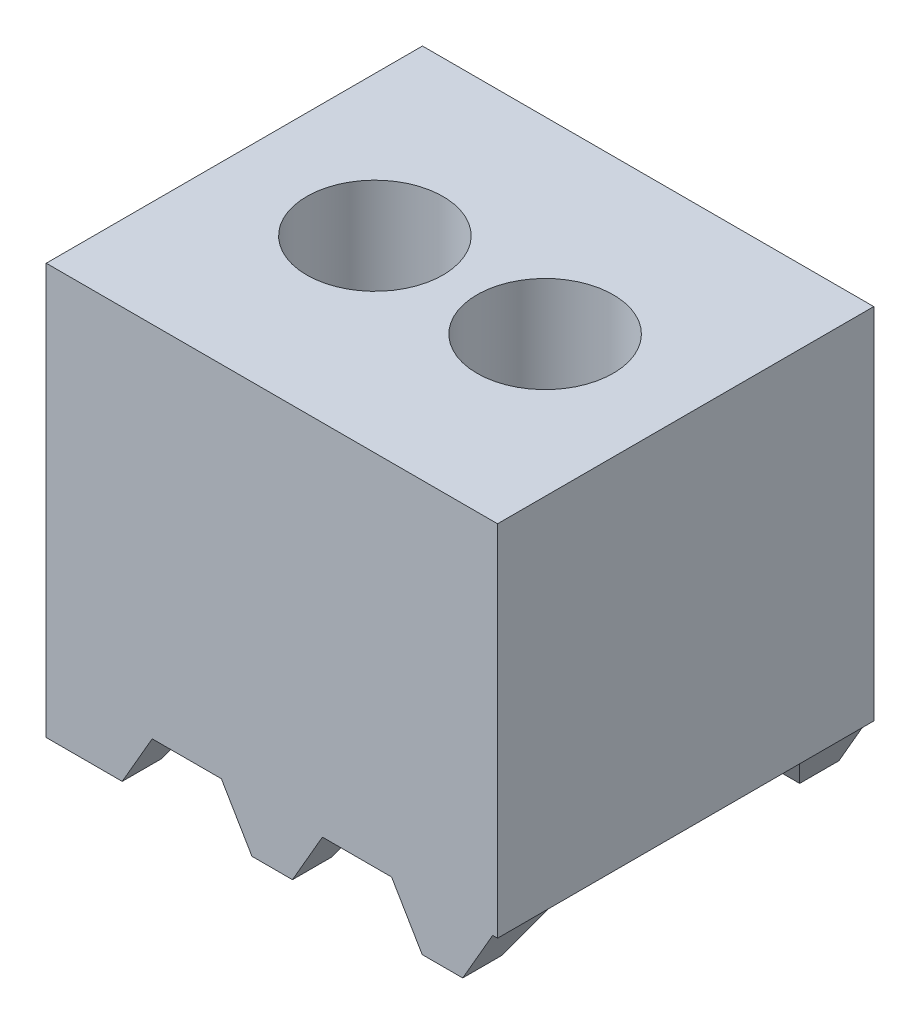
ISO-10303-21;
HEADER;
FILE_DESCRIPTION(('STEP AP214'),'2;1');
FILE_NAME('part.step','',(''),(''),'','','');
FILE_SCHEMA(('AUTOMOTIVE_DESIGN { 1 0 10303 214 1 1 1 1 }'));
ENDSEC;
DATA;
#1=APPLICATION_CONTEXT('core data for automotive mechanical design processes');
#2=APPLICATION_PROTOCOL_DEFINITION('international standard','automotive_design',2000,#1);
#3=PRODUCT_CONTEXT('',#1,'mechanical');
#4=PRODUCT('Part','Part','',(#3));
#5=PRODUCT_RELATED_PRODUCT_CATEGORY('part','',(#4));
#6=PRODUCT_DEFINITION_FORMATION('','',#4);
#7=PRODUCT_DEFINITION_CONTEXT('part definition',#1,'design');
#8=PRODUCT_DEFINITION('design','',#6,#7);
#9=PRODUCT_DEFINITION_SHAPE('','',#8);
#10=(LENGTH_UNIT() NAMED_UNIT(*) SI_UNIT(.MILLI.,.METRE.));
#11=(NAMED_UNIT(*) PLANE_ANGLE_UNIT() SI_UNIT($,.RADIAN.));
#12=(NAMED_UNIT(*) SI_UNIT($,.STERADIAN.) SOLID_ANGLE_UNIT());
#13=UNCERTAINTY_MEASURE_WITH_UNIT(LENGTH_MEASURE(1.E-05),#10,'distance_accuracy_value','');
#14=(GEOMETRIC_REPRESENTATION_CONTEXT(3) GLOBAL_UNCERTAINTY_ASSIGNED_CONTEXT((#13)) GLOBAL_UNIT_ASSIGNED_CONTEXT((#10,
#11,#12)) REPRESENTATION_CONTEXT('',''));
#15=CARTESIAN_POINT('',(0.,0.,0.));
#16=DIRECTION('',(0.,0.,1.));
#17=DIRECTION('',(1.,0.,0.));
#18=AXIS2_PLACEMENT_3D('',#15,#16,#17);
#19=CARTESIAN_POINT('',(0.,-2.413,0.));
#20=DIRECTION('',(0.,1.,0.));
#21=DIRECTION('',(0.,0.,1.));
#22=AXIS2_PLACEMENT_3D('',#19,#20,#21);
#23=PLANE('',#22);
#24=DIRECTION('',(1.,0.,0.));
#25=VECTOR('',#24,1.);
#26=CARTESIAN_POINT('',(0.,-2.413,-0.230423637951));
#27=LINE('',#26,#25);
#28=CARTESIAN_POINT('',(2.20832172,-2.413,-0.230423637951));
#29=VERTEX_POINT('',#28);
#30=CARTESIAN_POINT('',(2.44631972,-2.413,-0.230423637950996));
#31=VERTEX_POINT('',#30);
#32=EDGE_CURVE('E379',#29,#31,#27,.T.);
#33=ORIENTED_EDGE('',*,*,#32,.T.);
#34=DIRECTION('',(0.,0.,1.));
#35=VECTOR('',#34,1.);
#36=CARTESIAN_POINT('',(2.44631972,-2.413,-2.2098));
#37=LINE('',#36,#35);
#38=CARTESIAN_POINT('',(2.44631972,-2.413,0.));
#39=VERTEX_POINT('',#38);
#40=EDGE_CURVE('E198',#31,#39,#37,.T.);
#41=ORIENTED_EDGE('',*,*,#40,.T.);
#42=DIRECTION('',(1.,0.,0.));
#43=VECTOR('',#42,1.);
#44=CARTESIAN_POINT('',(0.,-2.413,0.));
#45=LINE('',#44,#43);
#46=CARTESIAN_POINT('',(2.20832172,-2.413,0.));
#47=VERTEX_POINT('',#46);
#48=EDGE_CURVE('E348',#47,#39,#45,.T.);
#49=ORIENTED_EDGE('',*,*,#48,.F.);
#50=DIRECTION('',(0.,0.,1.));
#51=VECTOR('',#50,1.);
#52=CARTESIAN_POINT('',(2.20832172,-2.413,-2.2098));
#53=LINE('',#52,#51);
#54=EDGE_CURVE('E245',#29,#47,#53,.T.);
#55=ORIENTED_EDGE('',*,*,#54,.F.);
#56=EDGE_LOOP('',(#33,#41,#49,#55));
#57=FACE_BOUND('',#56,.T.);
#58=ADVANCED_FACE('F16',(#57),#23,.F.);
#59=DIRECTION('',(-1.,0.,0.));
#60=VECTOR('',#59,1.);
#61=CARTESIAN_POINT('',(2.650998,-2.413,-2.20979999999999));
#62=LINE('',#61,#60);
#63=CARTESIAN_POINT('',(2.44631972,-2.413,-2.2098));
#64=VERTEX_POINT('',#63);
#65=CARTESIAN_POINT('',(2.20832172,-2.413,-2.2098));
#66=VERTEX_POINT('',#65);
#67=EDGE_CURVE('E355',#64,#66,#62,.T.);
#68=ORIENTED_EDGE('',*,*,#67,.F.);
#69=CARTESIAN_POINT('',(2.44631972,-2.413,-1.97937636204899));
#70=VERTEX_POINT('',#69);
#71=EDGE_CURVE('E204',#64,#70,#37,.T.);
#72=ORIENTED_EDGE('',*,*,#71,.T.);
#73=DIRECTION('',(-1.,0.,0.));
#74=VECTOR('',#73,1.);
#75=CARTESIAN_POINT('',(0.,-2.413,-1.97937636204899));
#76=LINE('',#75,#74);
#77=CARTESIAN_POINT('',(2.20832172,-2.413,-1.97937636204899));
#78=VERTEX_POINT('',#77);
#79=EDGE_CURVE('E377',#70,#78,#76,.T.);
#80=ORIENTED_EDGE('',*,*,#79,.T.);
#81=EDGE_CURVE('E242',#66,#78,#53,.T.);
#82=ORIENTED_EDGE('',*,*,#81,.F.);
#83=EDGE_LOOP('',(#68,#72,#80,#82));
#84=FACE_BOUND('',#83,.T.);
#85=ADVANCED_FACE('F408',(#84),#23,.F.);
#86=CARTESIAN_POINT('',(-61.230002,-2.1082,-0.4064));
#87=DIRECTION('',(0.,0.500000000000004,0.866025403784436));
#88=DIRECTION('',(0.,-0.866025403784436,0.500000000000004));
#89=AXIS2_PLACEMENT_3D('',#86,#87,#88);
#90=PLANE('',#89);
#91=DIRECTION('',(1.,0.,0.));
#92=VECTOR('',#91,1.);
#93=CARTESIAN_POINT('',(-61.230002,-2.1082,-0.4064));
#94=LINE('',#93,#92);
#95=CARTESIAN_POINT('',(2.028698082049,-2.1082,-0.4064));
#96=VERTEX_POINT('',#95);
#97=CARTESIAN_POINT('',(2.622296082049,-2.1082,-0.4064));
#98=VERTEX_POINT('',#97);
#99=EDGE_CURVE('E333',#96,#98,#94,.T.);
#100=ORIENTED_EDGE('',*,*,#99,.T.);
#101=DIRECTION('',(-0.447213595499953,-0.774596669241483,0.447213595499963));
#102=VECTOR('',#101,1.);
#103=CARTESIAN_POINT('',(-10.1481635343605,-24.2272848916281,12.3640596164098));
#104=LINE('',#103,#102);
#105=EDGE_CURVE('E218',#98,#31,#104,.T.);
#106=ORIENTED_EDGE('',*,*,#105,.T.);
#107=ORIENTED_EDGE('',*,*,#32,.F.);
#108=DIRECTION('',(-0.454582630893607,0.771372785213078,-0.445352285188327));
#109=VECTOR('',#108,1.);
#110=CARTESIAN_POINT('',(-11.0434192952276,20.0736320909451,-13.2130867288264));
#111=LINE('',#110,#109);
#112=EDGE_CURVE('E260',#29,#96,#111,.T.);
#113=ORIENTED_EDGE('',*,*,#112,.T.);
#114=EDGE_LOOP('',(#100,#106,#107,#113));
#115=FACE_BOUND('',#114,.T.);
#116=ADVANCED_FACE('F415',(#115),#90,.F.);
#117=CARTESIAN_POINT('',(-61.230002,-2.1082,-1.80339999999999));
#118=DIRECTION('',(0.,0.499999999999998,-0.86602540378444));
#119=DIRECTION('',(0.,0.86602540378444,0.499999999999998));
#120=AXIS2_PLACEMENT_3D('',#117,#118,#119);
#121=PLANE('',#120);
#122=ORIENTED_EDGE('',*,*,#79,.F.);
#123=DIRECTION('',(0.447213595499955,0.774596669241486,0.447213595499957));
#124=VECTOR('',#123,1.);
#125=CARTESIAN_POINT('',(-10.1481635343606,-24.2272848916282,-14.5738596164097));
#126=LINE('',#125,#124);
#127=CARTESIAN_POINT('',(2.622296082049,-2.1082,-1.80339999999999));
#128=VERTEX_POINT('',#127);
#129=EDGE_CURVE('E215',#70,#128,#126,.T.);
#130=ORIENTED_EDGE('',*,*,#129,.T.);
#131=DIRECTION('',(1.,0.,0.));
#132=VECTOR('',#131,1.);
#133=CARTESIAN_POINT('',(-61.230002,-2.1082,-1.80339999999999));
#134=LINE('',#133,#132);
#135=CARTESIAN_POINT('',(2.028698082049,-2.1082,-1.80339999999999));
#136=VERTEX_POINT('',#135);
#137=EDGE_CURVE('E195',#136,#128,#134,.T.);
#138=ORIENTED_EDGE('',*,*,#137,.F.);
#139=DIRECTION('',(0.454582630893609,-0.771372785213081,-0.445352285188321));
#140=VECTOR('',#139,1.);
#141=CARTESIAN_POINT('',(-11.0434192952276,20.0736320909453,11.0032867288263));
#142=LINE('',#141,#140);
#143=EDGE_CURVE('E257',#136,#78,#142,.T.);
#144=ORIENTED_EDGE('',*,*,#143,.T.);
#145=EDGE_LOOP('',(#122,#130,#138,#144));
#146=FACE_BOUND('',#145,.T.);
#147=ADVANCED_FACE('F448',(#146),#121,.F.);
#148=CARTESIAN_POINT('',(1.20832372,-2.413,-0.230423637951));
#149=VERTEX_POINT('',#148);
#150=CARTESIAN_POINT('',(1.44632172,-2.41300000000001,-0.230423637950995));
#151=VERTEX_POINT('',#150);
#152=EDGE_CURVE('E383',#149,#151,#27,.T.);
#153=ORIENTED_EDGE('',*,*,#152,.T.);
#154=DIRECTION('',(0.,0.,1.));
#155=VECTOR('',#154,1.);
#156=CARTESIAN_POINT('',(1.44632172,-2.413,-2.2098));
#157=LINE('',#156,#155);
#158=CARTESIAN_POINT('',(1.44632172,-2.413,0.));
#159=VERTEX_POINT('',#158);
#160=EDGE_CURVE('E249',#151,#159,#157,.T.);
#161=ORIENTED_EDGE('',*,*,#160,.T.);
#162=CARTESIAN_POINT('',(1.20832372,-2.413,0.));
#163=VERTEX_POINT('',#162);
#164=EDGE_CURVE('E354',#163,#159,#45,.T.);
#165=ORIENTED_EDGE('',*,*,#164,.F.);
#166=DIRECTION('',(0.,0.,1.));
#167=VECTOR('',#166,1.);
#168=CARTESIAN_POINT('',(1.20832372,-2.413,-2.2098));
#169=LINE('',#168,#167);
#170=EDGE_CURVE('E289',#149,#163,#169,.T.);
#171=ORIENTED_EDGE('',*,*,#170,.F.);
#172=EDGE_LOOP('',(#153,#161,#165,#171));
#173=FACE_BOUND('',#172,.T.);
#174=ADVANCED_FACE('F417',(#173),#23,.F.);
#175=CARTESIAN_POINT('',(1.44632172,-2.413,-2.2098));
#176=VERTEX_POINT('',#175);
#177=CARTESIAN_POINT('',(1.20832372,-2.413,-2.2098));
#178=VERTEX_POINT('',#177);
#179=EDGE_CURVE('E358',#176,#178,#62,.T.);
#180=ORIENTED_EDGE('',*,*,#179,.F.);
#181=CARTESIAN_POINT('',(1.44632172,-2.413,-1.97937636204899));
#182=VERTEX_POINT('',#181);
#183=EDGE_CURVE('E246',#176,#182,#157,.T.);
#184=ORIENTED_EDGE('',*,*,#183,.T.);
#185=CARTESIAN_POINT('',(1.20832372,-2.413,-1.97937636204899));
#186=VERTEX_POINT('',#185);
#187=EDGE_CURVE('E380',#182,#186,#76,.T.);
#188=ORIENTED_EDGE('',*,*,#187,.T.);
#189=EDGE_CURVE('E286',#178,#186,#169,.T.);
#190=ORIENTED_EDGE('',*,*,#189,.F.);
#191=EDGE_LOOP('',(#180,#184,#188,#190));
#192=FACE_BOUND('',#191,.T.);
#193=ADVANCED_FACE('F438',(#192),#23,.F.);
#194=CARTESIAN_POINT('',(1.028700082049,-2.1082,-0.4064));
#195=VERTEX_POINT('',#194);
#196=CARTESIAN_POINT('',(1.622298082049,-2.1082,-0.4064));
#197=VERTEX_POINT('',#196);
#198=EDGE_CURVE('E332',#195,#197,#94,.T.);
#199=ORIENTED_EDGE('',*,*,#198,.T.);
#200=DIRECTION('',(-0.447213595499953,-0.774596669241483,0.447213595499963));
#201=VECTOR('',#200,1.);
#202=CARTESIAN_POINT('',(-10.9481619343605,-23.8808754229347,12.1640600164098));
#203=LINE('',#202,#201);
#204=EDGE_CURVE('E254',#197,#151,#203,.T.);
#205=ORIENTED_EDGE('',*,*,#204,.T.);
#206=ORIENTED_EDGE('',*,*,#152,.F.);
#207=DIRECTION('',(-0.454582630893607,0.771372785213078,-0.445352285188327));
#208=VECTOR('',#207,1.);
#209=CARTESIAN_POINT('',(-11.8367723402081,19.7229801221486,-13.0106377202498));
#210=LINE('',#209,#208);
#211=EDGE_CURVE('E304',#149,#195,#210,.T.);
#212=ORIENTED_EDGE('',*,*,#211,.T.);
#213=EDGE_LOOP('',(#199,#205,#206,#212));
#214=FACE_BOUND('',#213,.T.);
#215=ADVANCED_FACE('F444',(#214),#90,.F.);
#216=ORIENTED_EDGE('',*,*,#187,.F.);
#217=DIRECTION('',(0.447213595499955,0.774596669241486,0.447213595499957));
#218=VECTOR('',#217,1.);
#219=CARTESIAN_POINT('',(-10.9481619343606,-23.8808754229348,-14.3738600164097));
#220=LINE('',#219,#218);
#221=CARTESIAN_POINT('',(1.622298082049,-2.1082,-1.80339999999999));
#222=VERTEX_POINT('',#221);
#223=EDGE_CURVE('E240',#182,#222,#220,.T.);
#224=ORIENTED_EDGE('',*,*,#223,.T.);
#225=CARTESIAN_POINT('',(1.028700082049,-2.1082,-1.80339999999999));
#226=VERTEX_POINT('',#225);
#227=EDGE_CURVE('E337',#226,#222,#134,.T.);
#228=ORIENTED_EDGE('',*,*,#227,.F.);
#229=DIRECTION('',(0.454582630893609,-0.771372785213081,-0.445352285188321));
#230=VECTOR('',#229,1.);
#231=CARTESIAN_POINT('',(-11.8367723402082,19.7229801221487,10.8008377202497));
#232=LINE('',#231,#230);
#233=EDGE_CURVE('E301',#226,#186,#232,.T.);
#234=ORIENTED_EDGE('',*,*,#233,.T.);
#235=EDGE_LOOP('',(#216,#224,#228,#234));
#236=FACE_BOUND('',#235,.T.);
#237=ADVANCED_FACE('F436',(#236),#121,.F.);
#238=CARTESIAN_POINT('',(0.,-2.413,-0.230423637951));
#239=VERTEX_POINT('',#238);
#240=CARTESIAN_POINT('',(0.446323719999987,-2.41300000000001,-0.230423637950997));
#241=VERTEX_POINT('',#240);
#242=EDGE_CURVE('E24',#239,#241,#27,.T.);
#243=ORIENTED_EDGE('',*,*,#242,.T.);
#244=DIRECTION('',(0.,0.,1.));
#245=VECTOR('',#244,1.);
#246=CARTESIAN_POINT('',(0.44632372,-2.413,-2.2098));
#247=LINE('',#246,#245);
#248=CARTESIAN_POINT('',(0.44632372,-2.413,0.));
#249=VERTEX_POINT('',#248);
#250=EDGE_CURVE('E293',#241,#249,#247,.T.);
#251=ORIENTED_EDGE('',*,*,#250,.T.);
#252=CARTESIAN_POINT('',(0.,-2.413,0.));
#253=VERTEX_POINT('',#252);
#254=EDGE_CURVE('E350',#253,#249,#45,.T.);
#255=ORIENTED_EDGE('',*,*,#254,.F.);
#256=DIRECTION('',(0.,0.,1.));
#257=VECTOR('',#256,1.);
#258=CARTESIAN_POINT('',(0.,-2.413,-2.2098));
#259=LINE('',#258,#257);
#260=EDGE_CURVE('E349',#239,#253,#259,.T.);
#261=ORIENTED_EDGE('',*,*,#260,.F.);
#262=EDGE_LOOP('',(#243,#251,#255,#261));
#263=FACE_BOUND('',#262,.T.);
#264=ADVANCED_FACE('F425',(#263),#23,.F.);
#265=CARTESIAN_POINT('',(0.,-2.413,-2.2098));
#266=DIRECTION('',(-1.,0.,0.));
#267=DIRECTION('',(0.,0.,1.));
#268=AXIS2_PLACEMENT_3D('',#265,#266,#267);
#269=PLANE('',#268);
#270=DIRECTION('',(0.,0.866025403784436,-0.500000000000004));
#271=VECTOR('',#270,1.);
#272=CARTESIAN_POINT('',(0.,-1.55590489340757,-0.725267728463258));
#273=LINE('',#272,#271);
#274=CARTESIAN_POINT('',(0.,-2.1082,-0.4064));
#275=VERTEX_POINT('',#274);
#276=EDGE_CURVE('E340',#239,#275,#273,.T.);
#277=ORIENTED_EDGE('',*,*,#276,.F.);
#278=ORIENTED_EDGE('',*,*,#260,.T.);
#279=DIRECTION('',(0.,1.,0.));
#280=VECTOR('',#279,1.);
#281=CARTESIAN_POINT('',(0.,-2.413,0.));
#282=LINE('',#281,#280);
#283=CARTESIAN_POINT('',(0.,0.,0.));
#284=VERTEX_POINT('',#283);
#285=EDGE_CURVE('E357',#253,#284,#282,.T.);
#286=ORIENTED_EDGE('',*,*,#285,.T.);
#287=DIRECTION('',(0.,0.,1.));
#288=VECTOR('',#287,1.);
#289=CARTESIAN_POINT('',(0.,0.,-2.2098));
#290=LINE('',#289,#288);
#291=CARTESIAN_POINT('',(0.,0.,-2.2098));
#292=VERTEX_POINT('',#291);
#293=EDGE_CURVE('E344',#292,#284,#290,.T.);
#294=ORIENTED_EDGE('',*,*,#293,.F.);
#295=DIRECTION('',(0.,1.,0.));
#296=VECTOR('',#295,1.);
#297=CARTESIAN_POINT('',(0.,-2.413,-2.2098));
#298=LINE('',#297,#296);
#299=CARTESIAN_POINT('',(0.,-2.413,-2.2098));
#300=VERTEX_POINT('',#299);
#301=EDGE_CURVE('E370',#300,#292,#298,.T.);
#302=ORIENTED_EDGE('',*,*,#301,.F.);
#303=CARTESIAN_POINT('',(0.,-2.413,-1.97937636204899));
#304=VERTEX_POINT('',#303);
#305=EDGE_CURVE('E345',#300,#304,#259,.T.);
#306=ORIENTED_EDGE('',*,*,#305,.T.);
#307=DIRECTION('',(0.,-0.86602540378444,-0.499999999999998));
#308=VECTOR('',#307,1.);
#309=CARTESIAN_POINT('',(0.,-2.512776362049,-2.03698227153674));
#310=LINE('',#309,#308);
#311=CARTESIAN_POINT('',(0.,-2.1082,-1.80339999999999));
#312=VERTEX_POINT('',#311);
#313=EDGE_CURVE('E331',#312,#304,#310,.T.);
#314=ORIENTED_EDGE('',*,*,#313,.F.);
#315=DIRECTION('',(0.,0.,-1.));
#316=VECTOR('',#315,1.);
#317=CARTESIAN_POINT('',(0.,-2.1082,-2.2098));
#318=LINE('',#317,#316);
#319=EDGE_CURVE('E342',#275,#312,#318,.T.);
#320=ORIENTED_EDGE('',*,*,#319,.F.);
#321=EDGE_LOOP('',(#277,#278,#286,#294,#302,#306,#314,#320));
#322=FACE_BOUND('',#321,.T.);
#323=ADVANCED_FACE('F18',(#322),#269,.T.);
#324=CARTESIAN_POINT('',(2.650998,-2.413,-2.20979999999999));
#325=DIRECTION('',(0.,0.,-1.));
#326=DIRECTION('',(-1.,0.,0.));
#327=AXIS2_PLACEMENT_3D('',#324,#325,#326);
#328=PLANE('',#327);
#329=DIRECTION('',(-1.,0.,0.));
#330=VECTOR('',#329,1.);
#331=CARTESIAN_POINT('',(2.622296082049,-2.1082,-2.2098));
#332=LINE('',#331,#330);
#333=CARTESIAN_POINT('',(2.650998,-2.1082,-2.20979999999999));
#334=VERTEX_POINT('',#333);
#335=CARTESIAN_POINT('',(2.622296082049,-2.1082,-2.2098));
#336=VERTEX_POINT('',#335);
#337=EDGE_CURVE('E191',#334,#336,#332,.T.);
#338=ORIENTED_EDGE('',*,*,#337,.T.);
#339=DIRECTION('',(-0.499999999999996,-0.866025403784441,0.));
#340=VECTOR('',#339,1.);
#341=CARTESIAN_POINT('',(2.44631972,-2.413,-2.2098));
#342=LINE('',#341,#340);
#343=EDGE_CURVE('E201',#336,#64,#342,.T.);
#344=ORIENTED_EDGE('',*,*,#343,.T.);
#345=ORIENTED_EDGE('',*,*,#67,.T.);
#346=DIRECTION('',(-0.507711928450994,0.861526899004653,0.));
#347=VECTOR('',#346,1.);
#348=CARTESIAN_POINT('',(2.20832172,-2.413,-2.2098));
#349=LINE('',#348,#347);
#350=CARTESIAN_POINT('',(2.028698082049,-2.1082,-2.2098));
#351=VERTEX_POINT('',#350);
#352=EDGE_CURVE('E229',#66,#351,#349,.T.);
#353=ORIENTED_EDGE('',*,*,#352,.T.);
#354=DIRECTION('',(-1.,0.,0.));
#355=VECTOR('',#354,1.);
#356=CARTESIAN_POINT('',(1.622298082049,-2.1082,-2.2098));
#357=LINE('',#356,#355);
#358=CARTESIAN_POINT('',(1.622298082049,-2.1082,-2.2098));
#359=VERTEX_POINT('',#358);
#360=EDGE_CURVE('E222',#351,#359,#357,.T.);
#361=ORIENTED_EDGE('',*,*,#360,.T.);
#362=DIRECTION('',(-0.499999999999996,-0.866025403784441,0.));
#363=VECTOR('',#362,1.);
#364=CARTESIAN_POINT('',(1.44632172,-2.413,-2.2098));
#365=LINE('',#364,#363);
#366=EDGE_CURVE('E225',#359,#176,#365,.T.);
#367=ORIENTED_EDGE('',*,*,#366,.T.);
#368=ORIENTED_EDGE('',*,*,#179,.T.);
#369=DIRECTION('',(-0.507711928450994,0.861526899004653,0.));
#370=VECTOR('',#369,1.);
#371=CARTESIAN_POINT('',(1.20832372,-2.413,-2.2098));
#372=LINE('',#371,#370);
#373=CARTESIAN_POINT('',(1.028700082049,-2.1082,-2.2098));
#374=VERTEX_POINT('',#373);
#375=EDGE_CURVE('E271',#178,#374,#372,.T.);
#376=ORIENTED_EDGE('',*,*,#375,.T.);
#377=DIRECTION('',(-1.,0.,0.));
#378=VECTOR('',#377,1.);
#379=CARTESIAN_POINT('',(0.622300082048996,-2.1082,-2.2098));
#380=LINE('',#379,#378);
#381=CARTESIAN_POINT('',(0.622300082048996,-2.1082,-2.2098));
#382=VERTEX_POINT('',#381);
#383=EDGE_CURVE('E264',#374,#382,#380,.T.);
#384=ORIENTED_EDGE('',*,*,#383,.T.);
#385=DIRECTION('',(-0.499999999999996,-0.866025403784441,0.));
#386=VECTOR('',#385,1.);
#387=CARTESIAN_POINT('',(0.44632372,-2.413,-2.2098));
#388=LINE('',#387,#386);
#389=CARTESIAN_POINT('',(0.44632372,-2.413,-2.2098));
#390=VERTEX_POINT('',#389);
#391=EDGE_CURVE('E267',#382,#390,#388,.T.);
#392=ORIENTED_EDGE('',*,*,#391,.T.);
#393=EDGE_CURVE('E353',#390,#300,#62,.T.);
#394=ORIENTED_EDGE('',*,*,#393,.T.);
#395=ORIENTED_EDGE('',*,*,#301,.T.);
#396=DIRECTION('',(-1.,0.,0.));
#397=VECTOR('',#396,1.);
#398=CARTESIAN_POINT('',(2.650998,0.,-2.20979999999999));
#399=LINE('',#398,#397);
#400=CARTESIAN_POINT('',(2.650998,0.,-2.20979999999999));
#401=VERTEX_POINT('',#400);
#402=EDGE_CURVE('E367',#401,#292,#399,.T.);
#403=ORIENTED_EDGE('',*,*,#402,.F.);
#404=DIRECTION('',(0.,1.,0.));
#405=VECTOR('',#404,1.);
#406=CARTESIAN_POINT('',(2.650998,-2.413,-2.20979999999999));
#407=LINE('',#406,#405);
#408=EDGE_CURVE('E210',#334,#401,#407,.T.);
#409=ORIENTED_EDGE('',*,*,#408,.F.);
#410=EDGE_LOOP('',(#338,#344,#345,#353,#361,#367,#368,#376,#384,#392,#394,#395,#403,#409));
#411=FACE_BOUND('',#410,.T.);
#412=ADVANCED_FACE('F208',(#411),#328,.T.);
#413=CARTESIAN_POINT('',(2.650998,-2.413,0.));
#414=DIRECTION('',(1.,0.,0.));
#415=DIRECTION('',(0.,0.,-1.));
#416=AXIS2_PLACEMENT_3D('',#413,#414,#415);
#417=PLANE('',#416);
#418=DIRECTION('',(0.,0.,1.));
#419=VECTOR('',#418,1.);
#420=CARTESIAN_POINT('',(2.650998,-2.1082,-0.4064));
#421=LINE('',#420,#419);
#422=CARTESIAN_POINT('',(2.650998,-2.1082,0.));
#423=VERTEX_POINT('',#422);
#424=EDGE_CURVE('E31',#334,#423,#421,.T.);
#425=ORIENTED_EDGE('',*,*,#424,.F.);
#426=ORIENTED_EDGE('',*,*,#408,.T.);
#427=DIRECTION('',(0.,0.,-1.));
#428=VECTOR('',#427,1.);
#429=CARTESIAN_POINT('',(2.650998,0.,0.));
#430=LINE('',#429,#428);
#431=CARTESIAN_POINT('',(2.650998,0.,0.));
#432=VERTEX_POINT('',#431);
#433=EDGE_CURVE('E364',#432,#401,#430,.T.);
#434=ORIENTED_EDGE('',*,*,#433,.F.);
#435=DIRECTION('',(0.,1.,0.));
#436=VECTOR('',#435,1.);
#437=CARTESIAN_POINT('',(2.650998,-2.413,0.));
#438=LINE('',#437,#436);
#439=EDGE_CURVE('E374',#423,#432,#438,.T.);
#440=ORIENTED_EDGE('',*,*,#439,.F.);
#441=EDGE_LOOP('',(#425,#426,#434,#440));
#442=FACE_BOUND('',#441,.T.);
#443=ADVANCED_FACE('F432',(#442),#417,.T.);
#444=CARTESIAN_POINT('',(0.,-2.413,0.));
#445=DIRECTION('',(0.,0.,1.));
#446=DIRECTION('',(1.,0.,0.));
#447=AXIS2_PLACEMENT_3D('',#444,#445,#446);
#448=PLANE('',#447);
#449=DIRECTION('',(-1.,0.,0.));
#450=VECTOR('',#449,1.);
#451=CARTESIAN_POINT('',(0.,-2.1082,0.));
#452=LINE('',#451,#450);
#453=CARTESIAN_POINT('',(2.622296082049,-2.1082,0.));
#454=VERTEX_POINT('',#453);
#455=EDGE_CURVE('E11',#423,#454,#452,.T.);
#456=ORIENTED_EDGE('',*,*,#455,.F.);
#457=ORIENTED_EDGE('',*,*,#439,.T.);
#458=DIRECTION('',(1.,0.,0.));
#459=VECTOR('',#458,1.);
#460=CARTESIAN_POINT('',(0.,0.,0.));
#461=LINE('',#460,#459);
#462=EDGE_CURVE('E361',#284,#432,#461,.T.);
#463=ORIENTED_EDGE('',*,*,#462,.F.);
#464=ORIENTED_EDGE('',*,*,#285,.F.);
#465=ORIENTED_EDGE('',*,*,#254,.T.);
#466=DIRECTION('',(-0.499999999999996,-0.866025403784441,0.));
#467=VECTOR('',#466,1.);
#468=CARTESIAN_POINT('',(0.44632372,-2.413,0.));
#469=LINE('',#468,#467);
#470=CARTESIAN_POINT('',(0.622300082048996,-2.1082,0.));
#471=VERTEX_POINT('',#470);
#472=EDGE_CURVE('E277',#471,#249,#469,.T.);
#473=ORIENTED_EDGE('',*,*,#472,.F.);
#474=DIRECTION('',(-1.,0.,0.));
#475=VECTOR('',#474,1.);
#476=CARTESIAN_POINT('',(0.622300082048996,-2.1082,0.));
#477=LINE('',#476,#475);
#478=CARTESIAN_POINT('',(1.028700082049,-2.1082,0.));
#479=VERTEX_POINT('',#478);
#480=EDGE_CURVE('E263',#479,#471,#477,.T.);
#481=ORIENTED_EDGE('',*,*,#480,.F.);
#482=DIRECTION('',(-0.507711928450994,0.861526899004653,0.));
#483=VECTOR('',#482,1.);
#484=CARTESIAN_POINT('',(1.20832372,-2.413,0.));
#485=LINE('',#484,#483);
#486=EDGE_CURVE('E268',#163,#479,#485,.T.);
#487=ORIENTED_EDGE('',*,*,#486,.F.);
#488=ORIENTED_EDGE('',*,*,#164,.T.);
#489=DIRECTION('',(-0.499999999999996,-0.866025403784441,0.));
#490=VECTOR('',#489,1.);
#491=CARTESIAN_POINT('',(1.44632172,-2.413,0.));
#492=LINE('',#491,#490);
#493=CARTESIAN_POINT('',(1.622298082049,-2.1082,0.));
#494=VERTEX_POINT('',#493);
#495=EDGE_CURVE('E234',#494,#159,#492,.T.);
#496=ORIENTED_EDGE('',*,*,#495,.F.);
#497=DIRECTION('',(-1.,0.,0.));
#498=VECTOR('',#497,1.);
#499=CARTESIAN_POINT('',(1.622298082049,-2.1082,0.));
#500=LINE('',#499,#498);
#501=CARTESIAN_POINT('',(2.028698082049,-2.1082,0.));
#502=VERTEX_POINT('',#501);
#503=EDGE_CURVE('E221',#502,#494,#500,.T.);
#504=ORIENTED_EDGE('',*,*,#503,.F.);
#505=DIRECTION('',(-0.507711928450994,0.861526899004653,0.));
#506=VECTOR('',#505,1.);
#507=CARTESIAN_POINT('',(2.20832172,-2.413,0.));
#508=LINE('',#507,#506);
#509=EDGE_CURVE('E226',#47,#502,#508,.T.);
#510=ORIENTED_EDGE('',*,*,#509,.F.);
#511=ORIENTED_EDGE('',*,*,#48,.T.);
#512=DIRECTION('',(-0.499999999999996,-0.866025403784441,0.));
#513=VECTOR('',#512,1.);
#514=CARTESIAN_POINT('',(2.44631972,-2.413,0.));
#515=LINE('',#514,#513);
#516=EDGE_CURVE('E211',#454,#39,#515,.T.);
#517=ORIENTED_EDGE('',*,*,#516,.F.);
#518=EDGE_LOOP('',(#456,#457,#463,#464,#465,#473,#481,#487,#488,#496,#504,#510,#511,#517));
#519=FACE_BOUND('',#518,.T.);
#520=ADVANCED_FACE('F423',(#519),#448,.T.);
#521=ORIENTED_EDGE('',*,*,#393,.F.);
#522=CARTESIAN_POINT('',(0.446323719999998,-2.413,-1.97937636204899));
#523=VERTEX_POINT('',#522);
#524=EDGE_CURVE('E290',#390,#523,#247,.T.);
#525=ORIENTED_EDGE('',*,*,#524,.T.);
#526=EDGE_CURVE('E372',#523,#304,#76,.T.);
#527=ORIENTED_EDGE('',*,*,#526,.T.);
#528=ORIENTED_EDGE('',*,*,#305,.F.);
#529=EDGE_LOOP('',(#521,#525,#527,#528));
#530=FACE_BOUND('',#529,.T.);
#531=ADVANCED_FACE('F411',(#530),#23,.F.);
#532=CARTESIAN_POINT('',(0.,0.,0.));
#533=DIRECTION('',(0.,1.,0.));
#534=DIRECTION('',(0.,0.,1.));
#535=AXIS2_PLACEMENT_3D('',#532,#533,#534);
#536=PLANE('',#535);
#537=CARTESIAN_POINT('',(1.825498,0.,-1.1049));
#538=DIRECTION('',(0.,1.,0.));
#539=DIRECTION('',(0.,0.,1.));
#540=AXIS2_PLACEMENT_3D('',#537,#538,#539);
#541=CIRCLE('',#540,0.400049999999999);
#542=CARTESIAN_POINT('',(1.825498,0.,-0.704849999999998));
#543=VERTEX_POINT('',#542);
#544=EDGE_CURVE('E307',#543,#543,#541,.T.);
#545=ORIENTED_EDGE('',*,*,#544,.F.);
#546=EDGE_LOOP('',(#545));
#547=FACE_BOUND('',#546,.T.);
#548=CARTESIAN_POINT('',(0.825499999999998,0.,-1.1049));
#549=DIRECTION('',(0.,1.,0.));
#550=DIRECTION('',(0.,0.,1.));
#551=AXIS2_PLACEMENT_3D('',#548,#549,#550);
#552=CIRCLE('',#551,0.400049999999999);
#553=CARTESIAN_POINT('',(0.825499999999998,0.,-0.704850000000001));
#554=VERTEX_POINT('',#553);
#555=EDGE_CURVE('E317',#554,#554,#552,.T.);
#556=ORIENTED_EDGE('',*,*,#555,.F.);
#557=EDGE_LOOP('',(#556));
#558=FACE_BOUND('',#557,.T.);
#559=ORIENTED_EDGE('',*,*,#293,.T.);
#560=ORIENTED_EDGE('',*,*,#462,.T.);
#561=ORIENTED_EDGE('',*,*,#433,.T.);
#562=ORIENTED_EDGE('',*,*,#402,.T.);
#563=EDGE_LOOP('',(#559,#560,#561,#562));
#564=FACE_BOUND('',#563,.T.);
#565=ADVANCED_FACE('F422',(#547,#558,#564),#536,.T.);
#566=CARTESIAN_POINT('',(0.622300082048996,-2.1082,-0.4064));
#567=VERTEX_POINT('',#566);
#568=EDGE_CURVE('E328',#275,#567,#94,.T.);
#569=ORIENTED_EDGE('',*,*,#568,.T.);
#570=DIRECTION('',(-0.447213595499953,-0.774596669241483,0.447213595499963));
#571=VECTOR('',#570,1.);
#572=CARTESIAN_POINT('',(-11.7481603343606,-23.5344659542412,11.9640604164098));
#573=LINE('',#572,#571);
#574=EDGE_CURVE('E298',#567,#241,#573,.T.);
#575=ORIENTED_EDGE('',*,*,#574,.T.);
#576=ORIENTED_EDGE('',*,*,#242,.F.);
#577=ORIENTED_EDGE('',*,*,#276,.T.);
#578=EDGE_LOOP('',(#569,#575,#576,#577));
#579=FACE_BOUND('',#578,.T.);
#580=ADVANCED_FACE('F430',(#579),#90,.F.);
#581=CARTESIAN_POINT('',(-61.230002,-2.1082,-0.4064));
#582=DIRECTION('',(0.,1.,0.));
#583=DIRECTION('',(0.,0.,1.));
#584=AXIS2_PLACEMENT_3D('',#581,#582,#583);
#585=PLANE('',#584);
#586=CARTESIAN_POINT('',(1.825498,-2.1082,-1.1049));
#587=DIRECTION('',(0.,1.,0.));
#588=DIRECTION('',(0.,0.,1.));
#589=AXIS2_PLACEMENT_3D('',#586,#587,#588);
#590=CIRCLE('',#589,0.32512);
#591=CARTESIAN_POINT('',(1.825498,-2.1082,-0.779779999999997));
#592=VERTEX_POINT('',#591);
#593=EDGE_CURVE('E316',#592,#592,#590,.T.);
#594=ORIENTED_EDGE('',*,*,#593,.T.);
#595=EDGE_LOOP('',(#594));
#596=FACE_BOUND('',#595,.T.);
#597=CARTESIAN_POINT('',(0.825499999999998,-2.1082,-1.1049));
#598=DIRECTION('',(0.,1.,0.));
#599=DIRECTION('',(0.,0.,1.));
#600=AXIS2_PLACEMENT_3D('',#597,#598,#599);
#601=CIRCLE('',#600,0.32512);
#602=CARTESIAN_POINT('',(0.825499999999998,-2.1082,-0.77978));
#603=VERTEX_POINT('',#602);
#604=EDGE_CURVE('E326',#603,#603,#601,.T.);
#605=ORIENTED_EDGE('',*,*,#604,.T.);
#606=EDGE_LOOP('',(#605));
#607=FACE_BOUND('',#606,.T.);
#608=ORIENTED_EDGE('',*,*,#137,.T.);
#609=DIRECTION('',(0.,0.,1.));
#610=VECTOR('',#609,1.);
#611=CARTESIAN_POINT('',(2.622296082049,-2.1082,-2.2098));
#612=LINE('',#611,#610);
#613=EDGE_CURVE('E187',#336,#128,#612,.T.);
#614=ORIENTED_EDGE('',*,*,#613,.F.);
#615=ORIENTED_EDGE('',*,*,#337,.F.);
#616=ORIENTED_EDGE('',*,*,#424,.T.);
#617=ORIENTED_EDGE('',*,*,#455,.T.);
#618=EDGE_CURVE('E39',#98,#454,#612,.T.);
#619=ORIENTED_EDGE('',*,*,#618,.F.);
#620=ORIENTED_EDGE('',*,*,#99,.F.);
#621=DIRECTION('',(0.,0.,1.));
#622=VECTOR('',#621,1.);
#623=CARTESIAN_POINT('',(2.028698082049,-2.1082,-2.2098));
#624=LINE('',#623,#622);
#625=EDGE_CURVE('E241',#96,#502,#624,.T.);
#626=ORIENTED_EDGE('',*,*,#625,.T.);
#627=ORIENTED_EDGE('',*,*,#503,.T.);
#628=DIRECTION('',(0.,0.,1.));
#629=VECTOR('',#628,1.);
#630=CARTESIAN_POINT('',(1.622298082049,-2.1082,-2.2098));
#631=LINE('',#630,#629);
#632=EDGE_CURVE('E232',#197,#494,#631,.T.);
#633=ORIENTED_EDGE('',*,*,#632,.F.);
#634=ORIENTED_EDGE('',*,*,#198,.F.);
#635=DIRECTION('',(0.,0.,1.));
#636=VECTOR('',#635,1.);
#637=CARTESIAN_POINT('',(1.028700082049,-2.1082,-2.2098));
#638=LINE('',#637,#636);
#639=EDGE_CURVE('E285',#195,#479,#638,.T.);
#640=ORIENTED_EDGE('',*,*,#639,.T.);
#641=ORIENTED_EDGE('',*,*,#480,.T.);
#642=DIRECTION('',(0.,0.,1.));
#643=VECTOR('',#642,1.);
#644=CARTESIAN_POINT('',(0.622300082048996,-2.1082,-2.2098));
#645=LINE('',#644,#643);
#646=EDGE_CURVE('E274',#567,#471,#645,.T.);
#647=ORIENTED_EDGE('',*,*,#646,.F.);
#648=ORIENTED_EDGE('',*,*,#568,.F.);
#649=ORIENTED_EDGE('',*,*,#319,.T.);
#650=CARTESIAN_POINT('',(0.622300082048987,-2.1082,-1.80339999999999));
#651=VERTEX_POINT('',#650);
#652=EDGE_CURVE('E334',#312,#651,#134,.T.);
#653=ORIENTED_EDGE('',*,*,#652,.T.);
#654=EDGE_CURVE('E294',#382,#651,#645,.T.);
#655=ORIENTED_EDGE('',*,*,#654,.F.);
#656=ORIENTED_EDGE('',*,*,#383,.F.);
#657=EDGE_CURVE('E281',#374,#226,#638,.T.);
#658=ORIENTED_EDGE('',*,*,#657,.T.);
#659=ORIENTED_EDGE('',*,*,#227,.T.);
#660=EDGE_CURVE('E250',#359,#222,#631,.T.);
#661=ORIENTED_EDGE('',*,*,#660,.F.);
#662=ORIENTED_EDGE('',*,*,#360,.F.);
#663=EDGE_CURVE('E238',#351,#136,#624,.T.);
#664=ORIENTED_EDGE('',*,*,#663,.T.);
#665=EDGE_LOOP('',(#608,#614,#615,#616,#617,#619,#620,#626,#627,#633,#634,#640,#641,#647,#648,
#649,#653,#655,#656,#658,#659,#661,#662,#664));
#666=FACE_BOUND('',#665,.T.);
#667=ADVANCED_FACE('F189',(#596,#607,#666),#585,.F.);
#668=ORIENTED_EDGE('',*,*,#526,.F.);
#669=DIRECTION('',(0.447213595499955,0.774596669241486,0.447213595499957));
#670=VECTOR('',#669,1.);
#671=CARTESIAN_POINT('',(-11.7481603343606,-23.5344659542413,-14.1738604164097));
#672=LINE('',#671,#670);
#673=EDGE_CURVE('E284',#523,#651,#672,.T.);
#674=ORIENTED_EDGE('',*,*,#673,.T.);
#675=ORIENTED_EDGE('',*,*,#652,.F.);
#676=ORIENTED_EDGE('',*,*,#313,.T.);
#677=EDGE_LOOP('',(#668,#674,#675,#676));
#678=FACE_BOUND('',#677,.T.);
#679=ADVANCED_FACE('F447',(#678),#121,.F.);
#680=CARTESIAN_POINT('',(0.825499999999998,0.,-1.1049));
#681=DIRECTION('',(0.,1.,0.));
#682=DIRECTION('',(0.,0.,1.));
#683=AXIS2_PLACEMENT_3D('',#680,#681,#682);
#684=CYLINDRICAL_SURFACE('',#683,0.32512);
#685=CARTESIAN_POINT('',(0.825499999999998,-0.680022486183735,-1.1049));
#686=DIRECTION('',(0.,1.,0.));
#687=DIRECTION('',(0.,0.,1.));
#688=AXIS2_PLACEMENT_3D('',#685,#686,#687);
#689=CIRCLE('',#688,0.32512);
#690=CARTESIAN_POINT('',(0.825499999999998,-0.680022486183735,-0.77978));
#691=VERTEX_POINT('',#690);
#692=EDGE_CURVE('E323',#691,#691,#689,.T.);
#693=ORIENTED_EDGE('',*,*,#692,.T.);
#694=EDGE_LOOP('',(#693));
#695=FACE_BOUND('',#694,.T.);
#696=ORIENTED_EDGE('',*,*,#604,.F.);
#697=EDGE_LOOP('',(#696));
#698=FACE_BOUND('',#697,.T.);
#699=ADVANCED_FACE('F749',(#695,#698),#684,.F.);
#700=CARTESIAN_POINT('',(0.825499999999998,-0.635,-1.1049));
#701=DIRECTION('',(0.,1.,0.));
#702=DIRECTION('',(0.,0.,1.));
#703=AXIS2_PLACEMENT_3D('',#700,#701,#702);
#704=CONICAL_SURFACE('',#703,0.40005,1.02974425867666);
#705=ORIENTED_EDGE('',*,*,#692,.F.);
#706=EDGE_LOOP('',(#705));
#707=FACE_BOUND('',#706,.T.);
#708=CARTESIAN_POINT('',(0.825499999999998,-0.635,-1.1049));
#709=DIRECTION('',(0.,1.,0.));
#710=DIRECTION('',(0.,0.,1.));
#711=AXIS2_PLACEMENT_3D('',#708,#709,#710);
#712=CIRCLE('',#711,0.40005);
#713=CARTESIAN_POINT('',(0.825499999999998,-0.635,-0.70485));
#714=VERTEX_POINT('',#713);
#715=EDGE_CURVE('E320',#714,#714,#712,.T.);
#716=ORIENTED_EDGE('',*,*,#715,.T.);
#717=EDGE_LOOP('',(#716));
#718=FACE_BOUND('',#717,.T.);
#719=ADVANCED_FACE('F404',(#707,#718),#704,.F.);
#720=CARTESIAN_POINT('',(0.825499999999998,0.,-1.1049));
#721=DIRECTION('',(0.,1.,0.));
#722=DIRECTION('',(0.,0.,1.));
#723=AXIS2_PLACEMENT_3D('',#720,#721,#722);
#724=CYLINDRICAL_SURFACE('',#723,0.400049999999999);
#725=ORIENTED_EDGE('',*,*,#715,.F.);
#726=EDGE_LOOP('',(#725));
#727=FACE_BOUND('',#726,.T.);
#728=ORIENTED_EDGE('',*,*,#555,.T.);
#729=EDGE_LOOP('',(#728));
#730=FACE_BOUND('',#729,.T.);
#731=ADVANCED_FACE('F393',(#727,#730),#724,.F.);
#732=CARTESIAN_POINT('',(1.825498,0.,-1.1049));
#733=DIRECTION('',(0.,1.,0.));
#734=DIRECTION('',(0.,0.,1.));
#735=AXIS2_PLACEMENT_3D('',#732,#733,#734);
#736=CYLINDRICAL_SURFACE('',#735,0.32512);
#737=CARTESIAN_POINT('',(1.825498,-0.680022486183735,-1.1049));
#738=DIRECTION('',(0.,1.,0.));
#739=DIRECTION('',(0.,0.,1.));
#740=AXIS2_PLACEMENT_3D('',#737,#738,#739);
#741=CIRCLE('',#740,0.32512);
#742=CARTESIAN_POINT('',(1.825498,-0.680022486183735,-0.779779999999997));
#743=VERTEX_POINT('',#742);
#744=EDGE_CURVE('E313',#743,#743,#741,.T.);
#745=ORIENTED_EDGE('',*,*,#744,.T.);
#746=EDGE_LOOP('',(#745));
#747=FACE_BOUND('',#746,.T.);
#748=ORIENTED_EDGE('',*,*,#593,.F.);
#749=EDGE_LOOP('',(#748));
#750=FACE_BOUND('',#749,.T.);
#751=ADVANCED_FACE('F390',(#747,#750),#736,.F.);
#752=CARTESIAN_POINT('',(1.825498,-0.635,-1.1049));
#753=DIRECTION('',(0.,1.,0.));
#754=DIRECTION('',(0.,0.,1.));
#755=AXIS2_PLACEMENT_3D('',#752,#753,#754);
#756=CONICAL_SURFACE('',#755,0.40005,1.02974425867666);
#757=ORIENTED_EDGE('',*,*,#744,.F.);
#758=EDGE_LOOP('',(#757));
#759=FACE_BOUND('',#758,.T.);
#760=CARTESIAN_POINT('',(1.825498,-0.635,-1.1049));
#761=DIRECTION('',(0.,1.,0.));
#762=DIRECTION('',(0.,0.,1.));
#763=AXIS2_PLACEMENT_3D('',#760,#761,#762);
#764=CIRCLE('',#763,0.40005);
#765=CARTESIAN_POINT('',(1.825498,-0.635,-0.704849999999998));
#766=VERTEX_POINT('',#765);
#767=EDGE_CURVE('E310',#766,#766,#764,.T.);
#768=ORIENTED_EDGE('',*,*,#767,.T.);
#769=EDGE_LOOP('',(#768));
#770=FACE_BOUND('',#769,.T.);
#771=ADVANCED_FACE('F392',(#759,#770),#756,.F.);
#772=CARTESIAN_POINT('',(1.825498,0.,-1.1049));
#773=DIRECTION('',(0.,1.,0.));
#774=DIRECTION('',(0.,0.,1.));
#775=AXIS2_PLACEMENT_3D('',#772,#773,#774);
#776=CYLINDRICAL_SURFACE('',#775,0.400049999999999);
#777=ORIENTED_EDGE('',*,*,#767,.F.);
#778=EDGE_LOOP('',(#777));
#779=FACE_BOUND('',#778,.T.);
#780=ORIENTED_EDGE('',*,*,#544,.T.);
#781=EDGE_LOOP('',(#780));
#782=FACE_BOUND('',#781,.T.);
#783=ADVANCED_FACE('F401',(#779,#782),#776,.F.);
#784=CARTESIAN_POINT('',(1.20832372,-2.413,-2.2098));
#785=DIRECTION('',(0.861526899004653,0.507711928450994,0.));
#786=DIRECTION('',(-0.507711928450994,0.861526899004653,0.));
#787=AXIS2_PLACEMENT_3D('',#784,#785,#786);
#788=PLANE('',#787);
#789=ORIENTED_EDGE('',*,*,#657,.F.);
#790=ORIENTED_EDGE('',*,*,#375,.F.);
#791=ORIENTED_EDGE('',*,*,#189,.T.);
#792=ORIENTED_EDGE('',*,*,#233,.F.);
#793=EDGE_LOOP('',(#789,#790,#791,#792));
#794=FACE_BOUND('',#793,.T.);
#795=ADVANCED_FACE('F586',(#794),#788,.F.);
#796=CARTESIAN_POINT('',(0.44632372,-2.413,-2.2098));
#797=DIRECTION('',(-0.866025403784441,0.499999999999996,0.));
#798=DIRECTION('',(-0.499999999999996,-0.866025403784441,0.));
#799=AXIS2_PLACEMENT_3D('',#796,#797,#798);
#800=PLANE('',#799);
#801=ORIENTED_EDGE('',*,*,#524,.F.);
#802=ORIENTED_EDGE('',*,*,#391,.F.);
#803=ORIENTED_EDGE('',*,*,#654,.T.);
#804=ORIENTED_EDGE('',*,*,#673,.F.);
#805=EDGE_LOOP('',(#801,#802,#803,#804));
#806=FACE_BOUND('',#805,.T.);
#807=ADVANCED_FACE('F598',(#806),#800,.F.);
#808=ORIENTED_EDGE('',*,*,#170,.T.);
#809=ORIENTED_EDGE('',*,*,#486,.T.);
#810=ORIENTED_EDGE('',*,*,#639,.F.);
#811=ORIENTED_EDGE('',*,*,#211,.F.);
#812=EDGE_LOOP('',(#808,#809,#810,#811));
#813=FACE_BOUND('',#812,.T.);
#814=ADVANCED_FACE('F601',(#813),#788,.F.);
#815=ORIENTED_EDGE('',*,*,#646,.T.);
#816=ORIENTED_EDGE('',*,*,#472,.T.);
#817=ORIENTED_EDGE('',*,*,#250,.F.);
#818=ORIENTED_EDGE('',*,*,#574,.F.);
#819=EDGE_LOOP('',(#815,#816,#817,#818));
#820=FACE_BOUND('',#819,.T.);
#821=ADVANCED_FACE('F612',(#820),#800,.F.);
#822=CARTESIAN_POINT('',(1.44632172,-2.413,-2.2098));
#823=DIRECTION('',(-0.866025403784441,0.499999999999996,0.));
#824=DIRECTION('',(-0.499999999999996,-0.866025403784441,0.));
#825=AXIS2_PLACEMENT_3D('',#822,#823,#824);
#826=PLANE('',#825);
#827=ORIENTED_EDGE('',*,*,#632,.T.);
#828=ORIENTED_EDGE('',*,*,#495,.T.);
#829=ORIENTED_EDGE('',*,*,#160,.F.);
#830=ORIENTED_EDGE('',*,*,#204,.F.);
#831=EDGE_LOOP('',(#827,#828,#829,#830));
#832=FACE_BOUND('',#831,.T.);
#833=ADVANCED_FACE('F627',(#832),#826,.F.);
#834=CARTESIAN_POINT('',(2.20832172,-2.413,-2.2098));
#835=DIRECTION('',(0.861526899004653,0.507711928450994,0.));
#836=DIRECTION('',(-0.507711928450994,0.861526899004653,0.));
#837=AXIS2_PLACEMENT_3D('',#834,#835,#836);
#838=PLANE('',#837);
#839=ORIENTED_EDGE('',*,*,#54,.T.);
#840=ORIENTED_EDGE('',*,*,#509,.T.);
#841=ORIENTED_EDGE('',*,*,#625,.F.);
#842=ORIENTED_EDGE('',*,*,#112,.F.);
#843=EDGE_LOOP('',(#839,#840,#841,#842));
#844=FACE_BOUND('',#843,.T.);
#845=ADVANCED_FACE('F636',(#844),#838,.F.);
#846=ORIENTED_EDGE('',*,*,#663,.F.);
#847=ORIENTED_EDGE('',*,*,#352,.F.);
#848=ORIENTED_EDGE('',*,*,#81,.T.);
#849=ORIENTED_EDGE('',*,*,#143,.F.);
#850=EDGE_LOOP('',(#846,#847,#848,#849));
#851=FACE_BOUND('',#850,.T.);
#852=ADVANCED_FACE('F647',(#851),#838,.F.);
#853=ORIENTED_EDGE('',*,*,#183,.F.);
#854=ORIENTED_EDGE('',*,*,#366,.F.);
#855=ORIENTED_EDGE('',*,*,#660,.T.);
#856=ORIENTED_EDGE('',*,*,#223,.F.);
#857=EDGE_LOOP('',(#853,#854,#855,#856));
#858=FACE_BOUND('',#857,.T.);
#859=ADVANCED_FACE('F639',(#858),#826,.F.);
#860=CARTESIAN_POINT('',(2.44631972,-2.413,-2.2098));
#861=DIRECTION('',(-0.866025403784441,0.499999999999996,0.));
#862=DIRECTION('',(-0.499999999999996,-0.866025403784441,0.));
#863=AXIS2_PLACEMENT_3D('',#860,#861,#862);
#864=PLANE('',#863);
#865=ORIENTED_EDGE('',*,*,#618,.T.);
#866=ORIENTED_EDGE('',*,*,#516,.T.);
#867=ORIENTED_EDGE('',*,*,#40,.F.);
#868=ORIENTED_EDGE('',*,*,#105,.F.);
#869=EDGE_LOOP('',(#865,#866,#867,#868));
#870=FACE_BOUND('',#869,.T.);
#871=ADVANCED_FACE('F665',(#870),#864,.F.);
#872=ORIENTED_EDGE('',*,*,#71,.F.);
#873=ORIENTED_EDGE('',*,*,#343,.F.);
#874=ORIENTED_EDGE('',*,*,#613,.T.);
#875=ORIENTED_EDGE('',*,*,#129,.F.);
#876=EDGE_LOOP('',(#872,#873,#874,#875));
#877=FACE_BOUND('',#876,.T.);
#878=ADVANCED_FACE('F202',(#877),#864,.F.);
#879=CLOSED_SHELL('',(#58,#85,#116,#147,#174,#193,#215,#237,#264,#323,#412,#443,#520,#531,#565,
#580,#667,#679,#699,#719,#731,#751,#771,#783,#795,#807,#814,#821,#833,#845,#852,#859,#871,#878));
#880=MANIFOLD_SOLID_BREP('B1',#879);
#881=ADVANCED_BREP_SHAPE_REPRESENTATION('',(#18,#880),#14);
#882=SHAPE_DEFINITION_REPRESENTATION(#9,#881);
ENDSEC;
END-ISO-10303-21;
